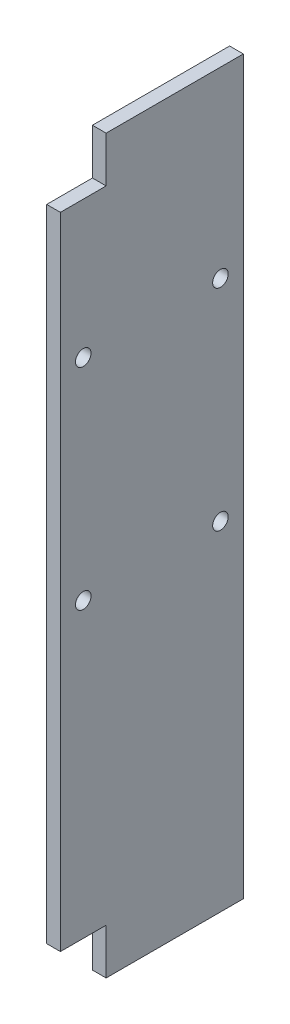
ISO-10303-21;
HEADER;
FILE_DESCRIPTION(('STEP AP214'),'2;1');
FILE_NAME('part.step','',(''),(''),'','','');
FILE_SCHEMA(('AUTOMOTIVE_DESIGN { 1 0 10303 214 1 1 1 1 }'));
ENDSEC;
DATA;
#1=APPLICATION_CONTEXT('core data for automotive mechanical design processes');
#2=APPLICATION_PROTOCOL_DEFINITION('international standard','automotive_design',2000,#1);
#3=PRODUCT_CONTEXT('',#1,'mechanical');
#4=PRODUCT('Part','Part','',(#3));
#5=PRODUCT_RELATED_PRODUCT_CATEGORY('part','',(#4));
#6=PRODUCT_DEFINITION_FORMATION('','',#4);
#7=PRODUCT_DEFINITION_CONTEXT('part definition',#1,'design');
#8=PRODUCT_DEFINITION('design','',#6,#7);
#9=PRODUCT_DEFINITION_SHAPE('','',#8);
#10=(LENGTH_UNIT() NAMED_UNIT(*) SI_UNIT(.MILLI.,.METRE.));
#11=(NAMED_UNIT(*) PLANE_ANGLE_UNIT() SI_UNIT($,.RADIAN.));
#12=(NAMED_UNIT(*) SI_UNIT($,.STERADIAN.) SOLID_ANGLE_UNIT());
#13=UNCERTAINTY_MEASURE_WITH_UNIT(LENGTH_MEASURE(1.E-05),#10,'distance_accuracy_value','');
#14=(GEOMETRIC_REPRESENTATION_CONTEXT(3) GLOBAL_UNCERTAINTY_ASSIGNED_CONTEXT((#13)) GLOBAL_UNIT_ASSIGNED_CONTEXT((#10,
#11,#12)) REPRESENTATION_CONTEXT('',''));
#15=CARTESIAN_POINT('',(0.,0.,0.));
#16=DIRECTION('',(0.,0.,1.));
#17=DIRECTION('',(1.,0.,0.));
#18=AXIS2_PLACEMENT_3D('',#15,#16,#17);
#19=CARTESIAN_POINT('',(15.,-344.,0.));
#20=DIRECTION('',(0.,1.,0.));
#21=DIRECTION('',(0.,0.,1.));
#22=AXIS2_PLACEMENT_3D('',#19,#20,#21);
#23=PLANE('',#22);
#24=DIRECTION('',(0.,0.,-1.));
#25=VECTOR('',#24,1.);
#26=CARTESIAN_POINT('',(0.,-344.,0.));
#27=LINE('',#26,#25);
#28=CARTESIAN_POINT('',(0.,-344.,115.));
#29=VERTEX_POINT('',#28);
#30=CARTESIAN_POINT('',(0.,-344.,64.9999999999999));
#31=VERTEX_POINT('',#30);
#32=EDGE_CURVE('E133',#29,#31,#27,.T.);
#33=ORIENTED_EDGE('',*,*,#32,.T.);
#34=DIRECTION('',(-1.,0.,0.));
#35=VECTOR('',#34,1.);
#36=CARTESIAN_POINT('',(15.,-344.,64.9999999999999));
#37=LINE('',#36,#35);
#38=CARTESIAN_POINT('',(15.,-344.,64.9999999999999));
#39=VERTEX_POINT('',#38);
#40=EDGE_CURVE('E11',#39,#31,#37,.T.);
#41=ORIENTED_EDGE('',*,*,#40,.F.);
#42=DIRECTION('',(0.,0.,-1.));
#43=VECTOR('',#42,1.);
#44=CARTESIAN_POINT('',(15.,-344.,0.));
#45=LINE('',#44,#43);
#46=CARTESIAN_POINT('',(15.,-344.,115.));
#47=VERTEX_POINT('',#46);
#48=EDGE_CURVE('E151',#47,#39,#45,.T.);
#49=ORIENTED_EDGE('',*,*,#48,.F.);
#50=DIRECTION('',(-1.,0.,0.));
#51=VECTOR('',#50,1.);
#52=CARTESIAN_POINT('',(15.,-344.,115.));
#53=LINE('',#52,#51);
#54=EDGE_CURVE('E129',#47,#29,#53,.T.);
#55=ORIENTED_EDGE('',*,*,#54,.T.);
#56=EDGE_LOOP('',(#33,#41,#49,#55));
#57=FACE_BOUND('',#56,.T.);
#58=ADVANCED_FACE('F37',(#57),#23,.F.);
#59=CARTESIAN_POINT('',(15.,0.,64.9999999999999));
#60=DIRECTION('',(0.,0.,-1.));
#61=DIRECTION('',(-1.,0.,0.));
#62=AXIS2_PLACEMENT_3D('',#59,#60,#61);
#63=PLANE('',#62);
#64=DIRECTION('',(0.,-1.,0.));
#65=VECTOR('',#64,1.);
#66=CARTESIAN_POINT('',(0.,0.,64.9999999999999));
#67=LINE('',#66,#65);
#68=CARTESIAN_POINT('',(0.,-394.,64.9999999999999));
#69=VERTEX_POINT('',#68);
#70=EDGE_CURVE('E136',#31,#69,#67,.T.);
#71=ORIENTED_EDGE('',*,*,#70,.T.);
#72=DIRECTION('',(-1.,0.,0.));
#73=VECTOR('',#72,1.);
#74=CARTESIAN_POINT('',(15.,-394.,64.9999999999999));
#75=LINE('',#74,#73);
#76=CARTESIAN_POINT('',(15.,-394.,64.9999999999999));
#77=VERTEX_POINT('',#76);
#78=EDGE_CURVE('E45',#77,#69,#75,.T.);
#79=ORIENTED_EDGE('',*,*,#78,.F.);
#80=DIRECTION('',(0.,-1.,0.));
#81=VECTOR('',#80,1.);
#82=CARTESIAN_POINT('',(15.,0.,64.9999999999999));
#83=LINE('',#82,#81);
#84=EDGE_CURVE('E96',#39,#77,#83,.T.);
#85=ORIENTED_EDGE('',*,*,#84,.F.);
#86=ORIENTED_EDGE('',*,*,#40,.T.);
#87=EDGE_LOOP('',(#71,#79,#85,#86));
#88=FACE_BOUND('',#87,.T.);
#89=ADVANCED_FACE('F236',(#88),#63,.F.);
#90=CARTESIAN_POINT('',(15.,-394.,0.));
#91=DIRECTION('',(0.,1.,0.));
#92=DIRECTION('',(0.,0.,1.));
#93=AXIS2_PLACEMENT_3D('',#90,#91,#92);
#94=PLANE('',#93);
#95=DIRECTION('',(0.,0.,-1.));
#96=VECTOR('',#95,1.);
#97=CARTESIAN_POINT('',(0.,-394.,0.));
#98=LINE('',#97,#96);
#99=CARTESIAN_POINT('',(0.,-394.,-85.0000000000001));
#100=VERTEX_POINT('',#99);
#101=EDGE_CURVE('E139',#69,#100,#98,.T.);
#102=ORIENTED_EDGE('',*,*,#101,.T.);
#103=DIRECTION('',(-1.,0.,0.));
#104=VECTOR('',#103,1.);
#105=CARTESIAN_POINT('',(15.,-394.,-85.0000000000001));
#106=LINE('',#105,#104);
#107=CARTESIAN_POINT('',(15.,-394.,-85.0000000000001));
#108=VERTEX_POINT('',#107);
#109=EDGE_CURVE('E157',#108,#100,#106,.T.);
#110=ORIENTED_EDGE('',*,*,#109,.F.);
#111=DIRECTION('',(0.,0.,-1.));
#112=VECTOR('',#111,1.);
#113=CARTESIAN_POINT('',(15.,-394.,0.));
#114=LINE('',#113,#112);
#115=EDGE_CURVE('E164',#77,#108,#114,.T.);
#116=ORIENTED_EDGE('',*,*,#115,.F.);
#117=ORIENTED_EDGE('',*,*,#78,.T.);
#118=EDGE_LOOP('',(#102,#110,#116,#117));
#119=FACE_BOUND('',#118,.T.);
#120=ADVANCED_FACE('F162',(#119),#94,.F.);
#121=CARTESIAN_POINT('',(15.,0.,-85.0000000000001));
#122=DIRECTION('',(0.,0.,-1.));
#123=DIRECTION('',(0.,1.,0.));
#124=AXIS2_PLACEMENT_3D('',#121,#122,#123);
#125=PLANE('',#124);
#126=DIRECTION('',(0.,-1.,0.));
#127=VECTOR('',#126,1.);
#128=CARTESIAN_POINT('',(0.,0.,-85.0000000000001));
#129=LINE('',#128,#127);
#130=CARTESIAN_POINT('',(0.,406.,-85.));
#131=VERTEX_POINT('',#130);
#132=EDGE_CURVE('E142',#131,#100,#129,.T.);
#133=ORIENTED_EDGE('',*,*,#132,.F.);
#134=DIRECTION('',(-1.,0.,0.));
#135=VECTOR('',#134,1.);
#136=CARTESIAN_POINT('',(15.,406.,-85.));
#137=LINE('',#136,#135);
#138=CARTESIAN_POINT('',(15.,406.,-85.));
#139=VERTEX_POINT('',#138);
#140=EDGE_CURVE('E155',#139,#131,#137,.T.);
#141=ORIENTED_EDGE('',*,*,#140,.F.);
#142=DIRECTION('',(0.,-1.,0.));
#143=VECTOR('',#142,1.);
#144=CARTESIAN_POINT('',(15.,0.,-85.0000000000001));
#145=LINE('',#144,#143);
#146=EDGE_CURVE('E173',#139,#108,#145,.T.);
#147=ORIENTED_EDGE('',*,*,#146,.T.);
#148=ORIENTED_EDGE('',*,*,#109,.T.);
#149=EDGE_LOOP('',(#133,#141,#147,#148));
#150=FACE_BOUND('',#149,.T.);
#151=ADVANCED_FACE('F171',(#150),#125,.T.);
#152=CARTESIAN_POINT('',(15.,406.,0.));
#153=DIRECTION('',(0.,1.,0.));
#154=DIRECTION('',(0.,0.,1.));
#155=AXIS2_PLACEMENT_3D('',#152,#153,#154);
#156=PLANE('',#155);
#157=DIRECTION('',(0.,0.,-1.));
#158=VECTOR('',#157,1.);
#159=CARTESIAN_POINT('',(0.,406.,0.));
#160=LINE('',#159,#158);
#161=CARTESIAN_POINT('',(0.,406.,65.));
#162=VERTEX_POINT('',#161);
#163=EDGE_CURVE('E145',#162,#131,#160,.T.);
#164=ORIENTED_EDGE('',*,*,#163,.F.);
#165=DIRECTION('',(-1.,0.,0.));
#166=VECTOR('',#165,1.);
#167=CARTESIAN_POINT('',(15.,406.,65.));
#168=LINE('',#167,#166);
#169=CARTESIAN_POINT('',(15.,406.,65.));
#170=VERTEX_POINT('',#169);
#171=EDGE_CURVE('E124',#170,#162,#168,.T.);
#172=ORIENTED_EDGE('',*,*,#171,.F.);
#173=DIRECTION('',(0.,0.,-1.));
#174=VECTOR('',#173,1.);
#175=CARTESIAN_POINT('',(15.,406.,0.));
#176=LINE('',#175,#174);
#177=EDGE_CURVE('E117',#170,#139,#176,.T.);
#178=ORIENTED_EDGE('',*,*,#177,.T.);
#179=ORIENTED_EDGE('',*,*,#140,.T.);
#180=EDGE_LOOP('',(#164,#172,#178,#179));
#181=FACE_BOUND('',#180,.T.);
#182=ADVANCED_FACE('F244',(#181),#156,.T.);
#183=CARTESIAN_POINT('',(15.,0.,65.));
#184=DIRECTION('',(0.,0.,-1.));
#185=DIRECTION('',(-1.,0.,0.));
#186=AXIS2_PLACEMENT_3D('',#183,#184,#185);
#187=PLANE('',#186);
#188=DIRECTION('',(0.,-1.,0.));
#189=VECTOR('',#188,1.);
#190=CARTESIAN_POINT('',(0.,0.,65.));
#191=LINE('',#190,#189);
#192=CARTESIAN_POINT('',(0.,356.,65.));
#193=VERTEX_POINT('',#192);
#194=EDGE_CURVE('E123',#162,#193,#191,.T.);
#195=ORIENTED_EDGE('',*,*,#194,.T.);
#196=DIRECTION('',(-1.,0.,0.));
#197=VECTOR('',#196,1.);
#198=CARTESIAN_POINT('',(15.,356.,65.));
#199=LINE('',#198,#197);
#200=CARTESIAN_POINT('',(15.,356.,65.));
#201=VERTEX_POINT('',#200);
#202=EDGE_CURVE('E120',#201,#193,#199,.T.);
#203=ORIENTED_EDGE('',*,*,#202,.F.);
#204=DIRECTION('',(0.,-1.,0.));
#205=VECTOR('',#204,1.);
#206=CARTESIAN_POINT('',(15.,0.,65.));
#207=LINE('',#206,#205);
#208=EDGE_CURVE('E110',#170,#201,#207,.T.);
#209=ORIENTED_EDGE('',*,*,#208,.F.);
#210=ORIENTED_EDGE('',*,*,#171,.T.);
#211=EDGE_LOOP('',(#195,#203,#209,#210));
#212=FACE_BOUND('',#211,.T.);
#213=ADVANCED_FACE('F121',(#212),#187,.F.);
#214=CARTESIAN_POINT('',(15.,356.,0.));
#215=DIRECTION('',(0.,-1.,0.));
#216=DIRECTION('',(0.,0.,-1.));
#217=AXIS2_PLACEMENT_3D('',#214,#215,#216);
#218=PLANE('',#217);
#219=DIRECTION('',(0.,0.,1.));
#220=VECTOR('',#219,1.);
#221=CARTESIAN_POINT('',(0.,356.,0.));
#222=LINE('',#221,#220);
#223=CARTESIAN_POINT('',(0.,356.,115.));
#224=VERTEX_POINT('',#223);
#225=EDGE_CURVE('E82',#193,#224,#222,.T.);
#226=ORIENTED_EDGE('',*,*,#225,.T.);
#227=DIRECTION('',(-1.,0.,0.));
#228=VECTOR('',#227,1.);
#229=CARTESIAN_POINT('',(15.,356.,115.));
#230=LINE('',#229,#228);
#231=CARTESIAN_POINT('',(15.,356.,115.));
#232=VERTEX_POINT('',#231);
#233=EDGE_CURVE('E125',#232,#224,#230,.T.);
#234=ORIENTED_EDGE('',*,*,#233,.F.);
#235=DIRECTION('',(0.,0.,1.));
#236=VECTOR('',#235,1.);
#237=CARTESIAN_POINT('',(15.,356.,0.));
#238=LINE('',#237,#236);
#239=EDGE_CURVE('E114',#201,#232,#238,.T.);
#240=ORIENTED_EDGE('',*,*,#239,.F.);
#241=ORIENTED_EDGE('',*,*,#202,.T.);
#242=EDGE_LOOP('',(#226,#234,#240,#241));
#243=FACE_BOUND('',#242,.T.);
#244=ADVANCED_FACE('F127',(#243),#218,.F.);
#245=CARTESIAN_POINT('',(15.,0.,115.));
#246=DIRECTION('',(0.,0.,-1.));
#247=DIRECTION('',(0.,1.,0.));
#248=AXIS2_PLACEMENT_3D('',#245,#246,#247);
#249=PLANE('',#248);
#250=DIRECTION('',(0.,-1.,0.));
#251=VECTOR('',#250,1.);
#252=CARTESIAN_POINT('',(0.,0.,115.));
#253=LINE('',#252,#251);
#254=EDGE_CURVE('E88',#224,#29,#253,.T.);
#255=ORIENTED_EDGE('',*,*,#254,.T.);
#256=ORIENTED_EDGE('',*,*,#54,.F.);
#257=DIRECTION('',(0.,-1.,0.));
#258=VECTOR('',#257,1.);
#259=CARTESIAN_POINT('',(15.,0.,115.));
#260=LINE('',#259,#258);
#261=EDGE_CURVE('E53',#232,#47,#260,.T.);
#262=ORIENTED_EDGE('',*,*,#261,.F.);
#263=ORIENTED_EDGE('',*,*,#233,.T.);
#264=EDGE_LOOP('',(#255,#256,#262,#263));
#265=FACE_BOUND('',#264,.T.);
#266=ADVANCED_FACE('F214',(#265),#249,.F.);
#267=CARTESIAN_POINT('',(15.,0.,0.));
#268=DIRECTION('',(1.,0.,0.));
#269=DIRECTION('',(0.,0.,-1.));
#270=AXIS2_PLACEMENT_3D('',#267,#268,#269);
#271=PLANE('',#270);
#272=CARTESIAN_POINT('',(15.,-24.,-60.0000000000001));
#273=DIRECTION('',(1.,0.,0.));
#274=DIRECTION('',(0.,0.,-1.));
#275=AXIS2_PLACEMENT_3D('',#272,#273,#274);
#276=CIRCLE('',#275,8.50000000000001);
#277=CARTESIAN_POINT('',(15.,-24.,-68.5000000000001));
#278=VERTEX_POINT('',#277);
#279=EDGE_CURVE('E184',#278,#278,#276,.T.);
#280=ORIENTED_EDGE('',*,*,#279,.F.);
#281=EDGE_LOOP('',(#280));
#282=FACE_BOUND('',#281,.T.);
#283=CARTESIAN_POINT('',(15.,206.,89.9999999999999));
#284=DIRECTION('',(1.,0.,0.));
#285=DIRECTION('',(0.,0.,-1.));
#286=AXIS2_PLACEMENT_3D('',#283,#284,#285);
#287=CIRCLE('',#286,8.50000000000001);
#288=CARTESIAN_POINT('',(15.,206.,81.4999999999999));
#289=VERTEX_POINT('',#288);
#290=EDGE_CURVE('E192',#289,#289,#287,.T.);
#291=ORIENTED_EDGE('',*,*,#290,.F.);
#292=EDGE_LOOP('',(#291));
#293=FACE_BOUND('',#292,.T.);
#294=CARTESIAN_POINT('',(15.,-24.,89.9999999999999));
#295=DIRECTION('',(1.,0.,0.));
#296=DIRECTION('',(0.,0.,-1.));
#297=AXIS2_PLACEMENT_3D('',#294,#295,#296);
#298=CIRCLE('',#297,8.50000000000001);
#299=CARTESIAN_POINT('',(15.,-24.,81.4999999999999));
#300=VERTEX_POINT('',#299);
#301=EDGE_CURVE('E185',#300,#300,#298,.T.);
#302=ORIENTED_EDGE('',*,*,#301,.F.);
#303=EDGE_LOOP('',(#302));
#304=FACE_BOUND('',#303,.T.);
#305=CARTESIAN_POINT('',(15.,206.,-60.));
#306=DIRECTION('',(1.,0.,0.));
#307=DIRECTION('',(0.,0.,-1.));
#308=AXIS2_PLACEMENT_3D('',#305,#306,#307);
#309=CIRCLE('',#308,8.50000000000001);
#310=CARTESIAN_POINT('',(15.,206.,-68.5));
#311=VERTEX_POINT('',#310);
#312=EDGE_CURVE('E137',#311,#311,#309,.T.);
#313=ORIENTED_EDGE('',*,*,#312,.F.);
#314=EDGE_LOOP('',(#313));
#315=FACE_BOUND('',#314,.T.);
#316=ORIENTED_EDGE('',*,*,#48,.T.);
#317=ORIENTED_EDGE('',*,*,#84,.T.);
#318=ORIENTED_EDGE('',*,*,#115,.T.);
#319=ORIENTED_EDGE('',*,*,#146,.F.);
#320=ORIENTED_EDGE('',*,*,#177,.F.);
#321=ORIENTED_EDGE('',*,*,#208,.T.);
#322=ORIENTED_EDGE('',*,*,#239,.T.);
#323=ORIENTED_EDGE('',*,*,#261,.T.);
#324=EDGE_LOOP('',(#316,#317,#318,#319,#320,#321,#322,#323));
#325=FACE_BOUND('',#324,.T.);
#326=ADVANCED_FACE('F112',(#282,#293,#304,#315,#325),#271,.T.);
#327=CARTESIAN_POINT('',(0.,0.,0.));
#328=DIRECTION('',(1.,0.,0.));
#329=DIRECTION('',(0.,0.,-1.));
#330=AXIS2_PLACEMENT_3D('',#327,#328,#329);
#331=PLANE('',#330);
#332=CARTESIAN_POINT('',(0.,-24.,-60.0000000000001));
#333=DIRECTION('',(1.,0.,0.));
#334=DIRECTION('',(0.,0.,-1.));
#335=AXIS2_PLACEMENT_3D('',#332,#333,#334);
#336=CIRCLE('',#335,8.50000000000001);
#337=CARTESIAN_POINT('',(0.,-24.,-68.5000000000001));
#338=VERTEX_POINT('',#337);
#339=EDGE_CURVE('E195',#338,#338,#336,.T.);
#340=ORIENTED_EDGE('',*,*,#339,.T.);
#341=EDGE_LOOP('',(#340));
#342=FACE_BOUND('',#341,.T.);
#343=CARTESIAN_POINT('',(0.,206.,89.9999999999999));
#344=DIRECTION('',(1.,0.,0.));
#345=DIRECTION('',(0.,0.,-1.));
#346=AXIS2_PLACEMENT_3D('',#343,#344,#345);
#347=CIRCLE('',#346,8.50000000000001);
#348=CARTESIAN_POINT('',(0.,206.,81.4999999999999));
#349=VERTEX_POINT('',#348);
#350=EDGE_CURVE('E188',#349,#349,#347,.T.);
#351=ORIENTED_EDGE('',*,*,#350,.T.);
#352=EDGE_LOOP('',(#351));
#353=FACE_BOUND('',#352,.T.);
#354=CARTESIAN_POINT('',(0.,-24.,89.9999999999999));
#355=DIRECTION('',(1.,0.,0.));
#356=DIRECTION('',(0.,0.,-1.));
#357=AXIS2_PLACEMENT_3D('',#354,#355,#356);
#358=CIRCLE('',#357,8.50000000000001);
#359=CARTESIAN_POINT('',(0.,-24.,81.4999999999999));
#360=VERTEX_POINT('',#359);
#361=EDGE_CURVE('E189',#360,#360,#358,.T.);
#362=ORIENTED_EDGE('',*,*,#361,.T.);
#363=EDGE_LOOP('',(#362));
#364=FACE_BOUND('',#363,.T.);
#365=CARTESIAN_POINT('',(0.,206.,-60.));
#366=DIRECTION('',(1.,0.,0.));
#367=DIRECTION('',(0.,0.,-1.));
#368=AXIS2_PLACEMENT_3D('',#365,#366,#367);
#369=CIRCLE('',#368,8.50000000000001);
#370=CARTESIAN_POINT('',(0.,206.,-68.5));
#371=VERTEX_POINT('',#370);
#372=EDGE_CURVE('E181',#371,#371,#369,.T.);
#373=ORIENTED_EDGE('',*,*,#372,.T.);
#374=EDGE_LOOP('',(#373));
#375=FACE_BOUND('',#374,.T.);
#376=ORIENTED_EDGE('',*,*,#32,.F.);
#377=ORIENTED_EDGE('',*,*,#254,.F.);
#378=ORIENTED_EDGE('',*,*,#225,.F.);
#379=ORIENTED_EDGE('',*,*,#194,.F.);
#380=ORIENTED_EDGE('',*,*,#163,.T.);
#381=ORIENTED_EDGE('',*,*,#132,.T.);
#382=ORIENTED_EDGE('',*,*,#101,.F.);
#383=ORIENTED_EDGE('',*,*,#70,.F.);
#384=EDGE_LOOP('',(#376,#377,#378,#379,#380,#381,#382,#383));
#385=FACE_BOUND('',#384,.T.);
#386=ADVANCED_FACE('F167',(#342,#353,#364,#375,#385),#331,.F.);
#387=CARTESIAN_POINT('',(39.0416305603426,206.,-60.));
#388=DIRECTION('',(-1.,0.,0.));
#389=DIRECTION('',(0.,0.,1.));
#390=AXIS2_PLACEMENT_3D('',#387,#388,#389);
#391=CYLINDRICAL_SURFACE('',#390,8.50000000000001);
#392=ORIENTED_EDGE('',*,*,#372,.F.);
#393=EDGE_LOOP('',(#392));
#394=FACE_BOUND('',#393,.T.);
#395=ORIENTED_EDGE('',*,*,#312,.T.);
#396=EDGE_LOOP('',(#395));
#397=FACE_BOUND('',#396,.T.);
#398=ADVANCED_FACE('F222',(#394,#397),#391,.F.);
#399=CARTESIAN_POINT('',(39.0416305603426,-24.,89.9999999999999));
#400=DIRECTION('',(-1.,0.,0.));
#401=DIRECTION('',(0.,0.,1.));
#402=AXIS2_PLACEMENT_3D('',#399,#400,#401);
#403=CYLINDRICAL_SURFACE('',#402,8.50000000000001);
#404=ORIENTED_EDGE('',*,*,#361,.F.);
#405=EDGE_LOOP('',(#404));
#406=FACE_BOUND('',#405,.T.);
#407=ORIENTED_EDGE('',*,*,#301,.T.);
#408=EDGE_LOOP('',(#407));
#409=FACE_BOUND('',#408,.T.);
#410=ADVANCED_FACE('F224',(#406,#409),#403,.F.);
#411=CARTESIAN_POINT('',(39.0416305603426,206.,89.9999999999999));
#412=DIRECTION('',(-1.,0.,0.));
#413=DIRECTION('',(0.,0.,1.));
#414=AXIS2_PLACEMENT_3D('',#411,#412,#413);
#415=CYLINDRICAL_SURFACE('',#414,8.50000000000001);
#416=ORIENTED_EDGE('',*,*,#350,.F.);
#417=EDGE_LOOP('',(#416));
#418=FACE_BOUND('',#417,.T.);
#419=ORIENTED_EDGE('',*,*,#290,.T.);
#420=EDGE_LOOP('',(#419));
#421=FACE_BOUND('',#420,.T.);
#422=ADVANCED_FACE('F208',(#418,#421),#415,.F.);
#423=CARTESIAN_POINT('',(39.0416305603426,-24.,-60.0000000000001));
#424=DIRECTION('',(-1.,0.,0.));
#425=DIRECTION('',(0.,0.,1.));
#426=AXIS2_PLACEMENT_3D('',#423,#424,#425);
#427=CYLINDRICAL_SURFACE('',#426,8.50000000000001);
#428=ORIENTED_EDGE('',*,*,#339,.F.);
#429=EDGE_LOOP('',(#428));
#430=FACE_BOUND('',#429,.T.);
#431=ORIENTED_EDGE('',*,*,#279,.T.);
#432=EDGE_LOOP('',(#431));
#433=FACE_BOUND('',#432,.T.);
#434=ADVANCED_FACE('F205',(#430,#433),#427,.F.);
#435=CLOSED_SHELL('',(#58,#89,#120,#151,#182,#213,#244,#266,#326,#386,#398,#410,#422,#434));
#436=MANIFOLD_SOLID_BREP('B2',#435);
#437=ADVANCED_BREP_SHAPE_REPRESENTATION('',(#18,#436),#14);
#438=SHAPE_DEFINITION_REPRESENTATION(#9,#437);
ENDSEC;
END-ISO-10303-21;
